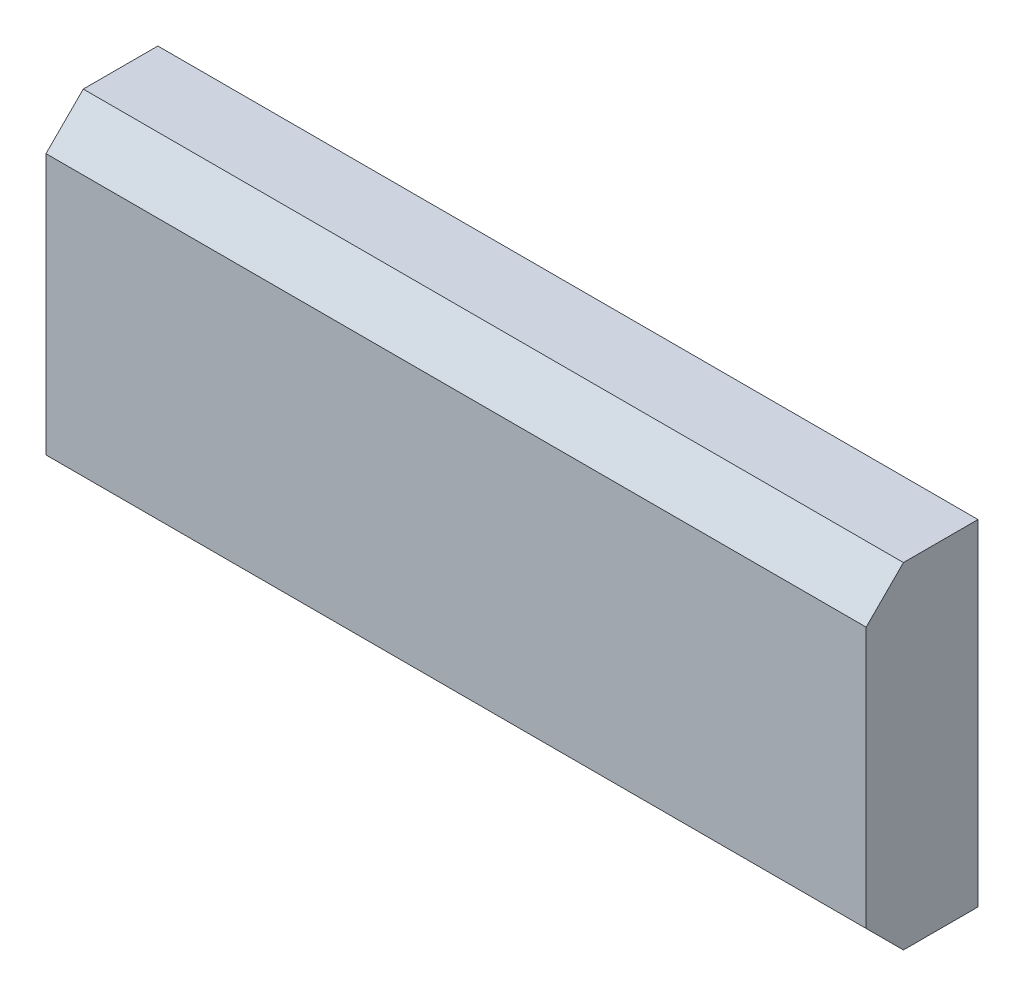
ISO-10303-21;
HEADER;
FILE_DESCRIPTION(('STEP AP214'),'2;1');
FILE_NAME('part.step','',(''),(''),'','','');
FILE_SCHEMA(('AUTOMOTIVE_DESIGN { 1 0 10303 214 1 1 1 1 }'));
ENDSEC;
DATA;
#1=APPLICATION_CONTEXT('core data for automotive mechanical design processes');
#2=APPLICATION_PROTOCOL_DEFINITION('international standard','automotive_design',2000,#1);
#3=PRODUCT_CONTEXT('',#1,'mechanical');
#4=PRODUCT('Part','Part','',(#3));
#5=PRODUCT_RELATED_PRODUCT_CATEGORY('part','',(#4));
#6=PRODUCT_DEFINITION_FORMATION('','',#4);
#7=PRODUCT_DEFINITION_CONTEXT('part definition',#1,'design');
#8=PRODUCT_DEFINITION('design','',#6,#7);
#9=PRODUCT_DEFINITION_SHAPE('','',#8);
#10=(LENGTH_UNIT() NAMED_UNIT(*) SI_UNIT(.MILLI.,.METRE.));
#11=(NAMED_UNIT(*) PLANE_ANGLE_UNIT() SI_UNIT($,.RADIAN.));
#12=(NAMED_UNIT(*) SI_UNIT($,.STERADIAN.) SOLID_ANGLE_UNIT());
#13=UNCERTAINTY_MEASURE_WITH_UNIT(LENGTH_MEASURE(1.E-05),#10,'distance_accuracy_value','');
#14=(GEOMETRIC_REPRESENTATION_CONTEXT(3) GLOBAL_UNCERTAINTY_ASSIGNED_CONTEXT((#13)) GLOBAL_UNIT_ASSIGNED_CONTEXT((#10,
#11,#12)) REPRESENTATION_CONTEXT('',''));
#15=CARTESIAN_POINT('',(0.,0.,0.));
#16=DIRECTION('',(0.,0.,1.));
#17=DIRECTION('',(1.,0.,0.));
#18=AXIS2_PLACEMENT_3D('',#15,#16,#17);
#19=CARTESIAN_POINT('',(-11.,-4.5,3.));
#20=DIRECTION('',(1.,0.,0.));
#21=DIRECTION('',(0.,0.,-1.));
#22=AXIS2_PLACEMENT_3D('',#19,#20,#21);
#23=PLANE('',#22);
#24=DIRECTION('',(0.,-1.,0.));
#25=VECTOR('',#24,1.);
#26=CARTESIAN_POINT('',(-11.,-4.5,3.));
#27=LINE('',#26,#25);
#28=CARTESIAN_POINT('',(-11.,3.5,3.));
#29=VERTEX_POINT('',#28);
#30=CARTESIAN_POINT('',(-11.,-3.5,3.));
#31=VERTEX_POINT('',#30);
#32=EDGE_CURVE('E118',#29,#31,#27,.T.);
#33=ORIENTED_EDGE('',*,*,#32,.F.);
#34=DIRECTION('',(0.,-0.707106781186546,0.707106781186549));
#35=VECTOR('',#34,1.);
#36=CARTESIAN_POINT('',(-11.,3.5,3.));
#37=LINE('',#36,#35);
#38=CARTESIAN_POINT('',(-11.,4.5,2.));
#39=VERTEX_POINT('',#38);
#40=EDGE_CURVE('E130',#29,#39,#37,.F.);
#41=ORIENTED_EDGE('',*,*,#40,.T.);
#42=DIRECTION('',(0.,0.,-1.));
#43=VECTOR('',#42,1.);
#44=CARTESIAN_POINT('',(-11.,4.5,3.));
#45=LINE('',#44,#43);
#46=CARTESIAN_POINT('',(-11.,4.5,0.));
#47=VERTEX_POINT('',#46);
#48=EDGE_CURVE('E108',#39,#47,#45,.T.);
#49=ORIENTED_EDGE('',*,*,#48,.T.);
#50=DIRECTION('',(0.,-1.,0.));
#51=VECTOR('',#50,1.);
#52=CARTESIAN_POINT('',(-11.,-4.5,0.));
#53=LINE('',#52,#51);
#54=CARTESIAN_POINT('',(-11.,-4.5,0.));
#55=VERTEX_POINT('',#54);
#56=EDGE_CURVE('E103',#47,#55,#53,.T.);
#57=ORIENTED_EDGE('',*,*,#56,.T.);
#58=DIRECTION('',(0.,0.,-1.));
#59=VECTOR('',#58,1.);
#60=CARTESIAN_POINT('',(-11.,-4.5,3.));
#61=LINE('',#60,#59);
#62=CARTESIAN_POINT('',(-11.,-4.5,2.));
#63=VERTEX_POINT('',#62);
#64=EDGE_CURVE('E87',#63,#55,#61,.T.);
#65=ORIENTED_EDGE('',*,*,#64,.F.);
#66=DIRECTION('',(0.,-0.707106781186546,-0.707106781186549));
#67=VECTOR('',#66,1.);
#68=CARTESIAN_POINT('',(-11.,-3.5,3.));
#69=LINE('',#68,#67);
#70=EDGE_CURVE('E128',#63,#31,#69,.F.);
#71=ORIENTED_EDGE('',*,*,#70,.T.);
#72=EDGE_LOOP('',(#33,#41,#49,#57,#65,#71));
#73=FACE_BOUND('',#72,.T.);
#74=ADVANCED_FACE('F34',(#73),#23,.F.);
#75=CARTESIAN_POINT('',(-11.,-4.5,3.));
#76=DIRECTION('',(0.,1.,0.));
#77=DIRECTION('',(0.,0.,1.));
#78=AXIS2_PLACEMENT_3D('',#75,#76,#77);
#79=PLANE('',#78);
#80=DIRECTION('',(0.,0.,-1.));
#81=VECTOR('',#80,1.);
#82=CARTESIAN_POINT('',(11.,-4.5,3.));
#83=LINE('',#82,#81);
#84=CARTESIAN_POINT('',(11.,-4.5,2.));
#85=VERTEX_POINT('',#84);
#86=CARTESIAN_POINT('',(11.,-4.5,0.));
#87=VERTEX_POINT('',#86);
#88=EDGE_CURVE('E97',#85,#87,#83,.T.);
#89=ORIENTED_EDGE('',*,*,#88,.F.);
#90=DIRECTION('',(-1.,0.,0.));
#91=VECTOR('',#90,1.);
#92=CARTESIAN_POINT('',(-11.,-4.5,2.));
#93=LINE('',#92,#91);
#94=EDGE_CURVE('E11',#85,#63,#93,.T.);
#95=ORIENTED_EDGE('',*,*,#94,.T.);
#96=ORIENTED_EDGE('',*,*,#64,.T.);
#97=DIRECTION('',(1.,0.,0.));
#98=VECTOR('',#97,1.);
#99=CARTESIAN_POINT('',(-11.,-4.5,0.));
#100=LINE('',#99,#98);
#101=EDGE_CURVE('E90',#55,#87,#100,.T.);
#102=ORIENTED_EDGE('',*,*,#101,.T.);
#103=EDGE_LOOP('',(#89,#95,#96,#102));
#104=FACE_BOUND('',#103,.T.);
#105=ADVANCED_FACE('F89',(#104),#79,.F.);
#106=CARTESIAN_POINT('',(11.,-4.5,3.));
#107=DIRECTION('',(-1.,0.,0.));
#108=DIRECTION('',(0.,0.,1.));
#109=AXIS2_PLACEMENT_3D('',#106,#107,#108);
#110=PLANE('',#109);
#111=DIRECTION('',(0.,0.,-1.));
#112=VECTOR('',#111,1.);
#113=CARTESIAN_POINT('',(11.,4.5,3.));
#114=LINE('',#113,#112);
#115=CARTESIAN_POINT('',(11.,4.5,2.));
#116=VERTEX_POINT('',#115);
#117=CARTESIAN_POINT('',(11.,4.5,0.));
#118=VERTEX_POINT('',#117);
#119=EDGE_CURVE('E120',#116,#118,#114,.T.);
#120=ORIENTED_EDGE('',*,*,#119,.F.);
#121=DIRECTION('',(0.,0.707106781186546,-0.707106781186549));
#122=VECTOR('',#121,1.);
#123=CARTESIAN_POINT('',(11.,3.5,3.));
#124=LINE('',#123,#122);
#125=CARTESIAN_POINT('',(11.,3.5,3.));
#126=VERTEX_POINT('',#125);
#127=EDGE_CURVE('E42',#116,#126,#124,.F.);
#128=ORIENTED_EDGE('',*,*,#127,.T.);
#129=DIRECTION('',(0.,1.,0.));
#130=VECTOR('',#129,1.);
#131=CARTESIAN_POINT('',(11.,-4.5,3.));
#132=LINE('',#131,#130);
#133=CARTESIAN_POINT('',(11.,-3.5,3.));
#134=VERTEX_POINT('',#133);
#135=EDGE_CURVE('E112',#134,#126,#132,.T.);
#136=ORIENTED_EDGE('',*,*,#135,.F.);
#137=DIRECTION('',(0.,0.707106781186546,0.707106781186549));
#138=VECTOR('',#137,1.);
#139=CARTESIAN_POINT('',(11.,-3.5,3.));
#140=LINE('',#139,#138);
#141=EDGE_CURVE('E49',#134,#85,#140,.F.);
#142=ORIENTED_EDGE('',*,*,#141,.T.);
#143=ORIENTED_EDGE('',*,*,#88,.T.);
#144=DIRECTION('',(0.,1.,0.));
#145=VECTOR('',#144,1.);
#146=CARTESIAN_POINT('',(11.,-4.5,0.));
#147=LINE('',#146,#145);
#148=EDGE_CURVE('E105',#87,#118,#147,.T.);
#149=ORIENTED_EDGE('',*,*,#148,.T.);
#150=EDGE_LOOP('',(#120,#128,#136,#142,#143,#149));
#151=FACE_BOUND('',#150,.T.);
#152=ADVANCED_FACE('F135',(#151),#110,.F.);
#153=CARTESIAN_POINT('',(-11.,4.5,3.));
#154=DIRECTION('',(0.,-1.,0.));
#155=DIRECTION('',(0.,0.,-1.));
#156=AXIS2_PLACEMENT_3D('',#153,#154,#155);
#157=PLANE('',#156);
#158=ORIENTED_EDGE('',*,*,#48,.F.);
#159=DIRECTION('',(1.,0.,0.));
#160=VECTOR('',#159,1.);
#161=CARTESIAN_POINT('',(-11.,4.5,2.));
#162=LINE('',#161,#160);
#163=EDGE_CURVE('E57',#39,#116,#162,.T.);
#164=ORIENTED_EDGE('',*,*,#163,.T.);
#165=ORIENTED_EDGE('',*,*,#119,.T.);
#166=DIRECTION('',(-1.,0.,0.));
#167=VECTOR('',#166,1.);
#168=CARTESIAN_POINT('',(-11.,4.5,0.));
#169=LINE('',#168,#167);
#170=EDGE_CURVE('E116',#118,#47,#169,.T.);
#171=ORIENTED_EDGE('',*,*,#170,.T.);
#172=EDGE_LOOP('',(#158,#164,#165,#171));
#173=FACE_BOUND('',#172,.T.);
#174=ADVANCED_FACE('F143',(#173),#157,.F.);
#175=CARTESIAN_POINT('',(-11.,4.5,3.));
#176=DIRECTION('',(0.,0.,-1.));
#177=DIRECTION('',(-1.,0.,0.));
#178=AXIS2_PLACEMENT_3D('',#175,#176,#177);
#179=PLANE('',#178);
#180=ORIENTED_EDGE('',*,*,#135,.T.);
#181=DIRECTION('',(-1.,0.,0.));
#182=VECTOR('',#181,1.);
#183=CARTESIAN_POINT('',(-11.,3.5,3.));
#184=LINE('',#183,#182);
#185=EDGE_CURVE('E125',#126,#29,#184,.T.);
#186=ORIENTED_EDGE('',*,*,#185,.T.);
#187=ORIENTED_EDGE('',*,*,#32,.T.);
#188=DIRECTION('',(1.,0.,0.));
#189=VECTOR('',#188,1.);
#190=CARTESIAN_POINT('',(-11.,-3.5,3.));
#191=LINE('',#190,#189);
#192=EDGE_CURVE('E96',#31,#134,#191,.T.);
#193=ORIENTED_EDGE('',*,*,#192,.T.);
#194=EDGE_LOOP('',(#180,#186,#187,#193));
#195=FACE_BOUND('',#194,.T.);
#196=ADVANCED_FACE('F139',(#195),#179,.F.);
#197=CARTESIAN_POINT('',(-11.,4.5,0.));
#198=DIRECTION('',(0.,0.,-1.));
#199=DIRECTION('',(-1.,0.,0.));
#200=AXIS2_PLACEMENT_3D('',#197,#198,#199);
#201=PLANE('',#200);
#202=ORIENTED_EDGE('',*,*,#56,.F.);
#203=ORIENTED_EDGE('',*,*,#170,.F.);
#204=ORIENTED_EDGE('',*,*,#148,.F.);
#205=ORIENTED_EDGE('',*,*,#101,.F.);
#206=EDGE_LOOP('',(#202,#203,#204,#205));
#207=FACE_BOUND('',#206,.T.);
#208=ADVANCED_FACE('F101',(#207),#201,.T.);
#209=CARTESIAN_POINT('',(-11.,3.5,3.));
#210=DIRECTION('',(0.,-0.707106781186549,-0.707106781186546));
#211=DIRECTION('',(0.,0.707106781186546,-0.707106781186549));
#212=AXIS2_PLACEMENT_3D('',#209,#210,#211);
#213=PLANE('',#212);
#214=ORIENTED_EDGE('',*,*,#127,.F.);
#215=ORIENTED_EDGE('',*,*,#163,.F.);
#216=ORIENTED_EDGE('',*,*,#40,.F.);
#217=ORIENTED_EDGE('',*,*,#185,.F.);
#218=EDGE_LOOP('',(#214,#215,#216,#217));
#219=FACE_BOUND('',#218,.T.);
#220=ADVANCED_FACE('F142',(#219),#213,.F.);
#221=CARTESIAN_POINT('',(-11.,-3.5,3.));
#222=DIRECTION('',(0.,0.707106781186549,-0.707106781186546));
#223=DIRECTION('',(0.,0.707106781186546,0.707106781186549));
#224=AXIS2_PLACEMENT_3D('',#221,#222,#223);
#225=PLANE('',#224);
#226=ORIENTED_EDGE('',*,*,#70,.F.);
#227=ORIENTED_EDGE('',*,*,#94,.F.);
#228=ORIENTED_EDGE('',*,*,#141,.F.);
#229=ORIENTED_EDGE('',*,*,#192,.F.);
#230=EDGE_LOOP('',(#226,#227,#228,#229));
#231=FACE_BOUND('',#230,.T.);
#232=ADVANCED_FACE('F36',(#231),#225,.F.);
#233=CLOSED_SHELL('',(#74,#105,#152,#174,#196,#208,#220,#232));
#234=MANIFOLD_SOLID_BREP('B2',#233);
#235=ADVANCED_BREP_SHAPE_REPRESENTATION('',(#18,#234),#14);
#236=SHAPE_DEFINITION_REPRESENTATION(#9,#235);
ENDSEC;
END-ISO-10303-21;
